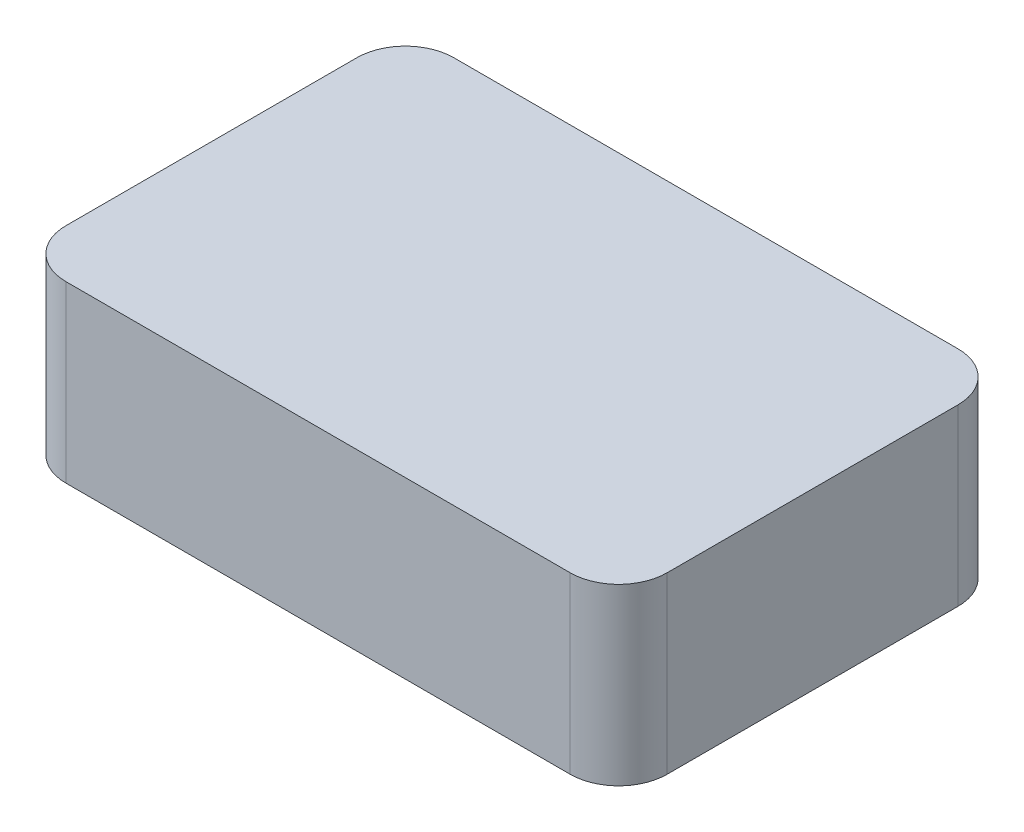
ISO-10303-21;
HEADER;
FILE_DESCRIPTION(('STEP AP214'),'2;1');
FILE_NAME('part.step','',(''),(''),'','','');
FILE_SCHEMA(('AUTOMOTIVE_DESIGN { 1 0 10303 214 1 1 1 1 }'));
ENDSEC;
DATA;
#1=APPLICATION_CONTEXT('core data for automotive mechanical design processes');
#2=APPLICATION_PROTOCOL_DEFINITION('international standard','automotive_design',2000,#1);
#3=PRODUCT_CONTEXT('',#1,'mechanical');
#4=PRODUCT('Part','Part','',(#3));
#5=PRODUCT_RELATED_PRODUCT_CATEGORY('part','',(#4));
#6=PRODUCT_DEFINITION_FORMATION('','',#4);
#7=PRODUCT_DEFINITION_CONTEXT('part definition',#1,'design');
#8=PRODUCT_DEFINITION('design','',#6,#7);
#9=PRODUCT_DEFINITION_SHAPE('','',#8);
#10=(LENGTH_UNIT() NAMED_UNIT(*) SI_UNIT(.MILLI.,.METRE.));
#11=(NAMED_UNIT(*) PLANE_ANGLE_UNIT() SI_UNIT($,.RADIAN.));
#12=(NAMED_UNIT(*) SI_UNIT($,.STERADIAN.) SOLID_ANGLE_UNIT());
#13=UNCERTAINTY_MEASURE_WITH_UNIT(LENGTH_MEASURE(1.E-05),#10,'distance_accuracy_value','');
#14=(GEOMETRIC_REPRESENTATION_CONTEXT(3) GLOBAL_UNCERTAINTY_ASSIGNED_CONTEXT((#13)) GLOBAL_UNIT_ASSIGNED_CONTEXT((#10,
#11,#12)) REPRESENTATION_CONTEXT('',''));
#15=CARTESIAN_POINT('',(0.,0.,0.));
#16=DIRECTION('',(0.,0.,1.));
#17=DIRECTION('',(1.,0.,0.));
#18=AXIS2_PLACEMENT_3D('',#15,#16,#17);
#19=CARTESIAN_POINT('',(15.5,4.5,10.));
#20=DIRECTION('',(-1.,0.,0.));
#21=DIRECTION('',(0.,0.,1.));
#22=AXIS2_PLACEMENT_3D('',#19,#20,#21);
#23=PLANE('',#22);
#24=DIRECTION('',(0.,0.,-1.));
#25=VECTOR('',#24,1.);
#26=CARTESIAN_POINT('',(15.5,-4.5,10.));
#27=LINE('',#26,#25);
#28=CARTESIAN_POINT('',(15.5,-4.5,7.5));
#29=VERTEX_POINT('',#28);
#30=CARTESIAN_POINT('',(15.5,-4.5,-7.5));
#31=VERTEX_POINT('',#30);
#32=EDGE_CURVE('E143',#29,#31,#27,.T.);
#33=ORIENTED_EDGE('',*,*,#32,.T.);
#34=DIRECTION('',(0.,-1.,0.));
#35=VECTOR('',#34,1.);
#36=CARTESIAN_POINT('',(15.5,4.5,-7.5));
#37=LINE('',#36,#35);
#38=CARTESIAN_POINT('',(15.5,4.5,-7.5));
#39=VERTEX_POINT('',#38);
#40=EDGE_CURVE('E177',#31,#39,#37,.F.);
#41=ORIENTED_EDGE('',*,*,#40,.T.);
#42=DIRECTION('',(0.,0.,-1.));
#43=VECTOR('',#42,1.);
#44=CARTESIAN_POINT('',(15.5,4.5,10.));
#45=LINE('',#44,#43);
#46=CARTESIAN_POINT('',(15.5,4.5,7.5));
#47=VERTEX_POINT('',#46);
#48=EDGE_CURVE('E141',#47,#39,#45,.T.);
#49=ORIENTED_EDGE('',*,*,#48,.F.);
#50=DIRECTION('',(0.,-1.,0.));
#51=VECTOR('',#50,1.);
#52=CARTESIAN_POINT('',(15.5,4.5,7.5));
#53=LINE('',#52,#51);
#54=EDGE_CURVE('E173',#47,#29,#53,.T.);
#55=ORIENTED_EDGE('',*,*,#54,.T.);
#56=EDGE_LOOP('',(#33,#41,#49,#55));
#57=FACE_BOUND('',#56,.T.);
#58=ADVANCED_FACE('F42',(#57),#23,.F.);
#59=CARTESIAN_POINT('',(-15.5,4.5,-10.));
#60=DIRECTION('',(0.,0.,1.));
#61=DIRECTION('',(1.,0.,0.));
#62=AXIS2_PLACEMENT_3D('',#59,#60,#61);
#63=PLANE('',#62);
#64=DIRECTION('',(-1.,0.,0.));
#65=VECTOR('',#64,1.);
#66=CARTESIAN_POINT('',(-15.5,-4.5,-10.));
#67=LINE('',#66,#65);
#68=CARTESIAN_POINT('',(13.,-4.5,-10.));
#69=VERTEX_POINT('',#68);
#70=CARTESIAN_POINT('',(-13.,-4.5,-10.));
#71=VERTEX_POINT('',#70);
#72=EDGE_CURVE('E137',#69,#71,#67,.T.);
#73=ORIENTED_EDGE('',*,*,#72,.T.);
#74=DIRECTION('',(0.,-1.,0.));
#75=VECTOR('',#74,1.);
#76=CARTESIAN_POINT('',(-13.,4.5,-10.));
#77=LINE('',#76,#75);
#78=CARTESIAN_POINT('',(-13.,4.5,-10.));
#79=VERTEX_POINT('',#78);
#80=EDGE_CURVE('E113',#71,#79,#77,.F.);
#81=ORIENTED_EDGE('',*,*,#80,.T.);
#82=DIRECTION('',(-1.,0.,0.));
#83=VECTOR('',#82,1.);
#84=CARTESIAN_POINT('',(-15.5,4.5,-10.));
#85=LINE('',#84,#83);
#86=CARTESIAN_POINT('',(13.,4.5,-10.));
#87=VERTEX_POINT('',#86);
#88=EDGE_CURVE('E196',#87,#79,#85,.T.);
#89=ORIENTED_EDGE('',*,*,#88,.F.);
#90=DIRECTION('',(0.,-1.,0.));
#91=VECTOR('',#90,1.);
#92=CARTESIAN_POINT('',(13.,4.5,-10.));
#93=LINE('',#92,#91);
#94=EDGE_CURVE('E119',#87,#69,#93,.T.);
#95=ORIENTED_EDGE('',*,*,#94,.T.);
#96=EDGE_LOOP('',(#73,#81,#89,#95));
#97=FACE_BOUND('',#96,.T.);
#98=ADVANCED_FACE('F217',(#97),#63,.F.);
#99=CARTESIAN_POINT('',(-15.5,4.5,10.));
#100=DIRECTION('',(1.,0.,0.));
#101=DIRECTION('',(0.,0.,-1.));
#102=AXIS2_PLACEMENT_3D('',#99,#100,#101);
#103=PLANE('',#102);
#104=DIRECTION('',(0.,0.,1.));
#105=VECTOR('',#104,1.);
#106=CARTESIAN_POINT('',(-15.5,4.5,10.));
#107=LINE('',#106,#105);
#108=CARTESIAN_POINT('',(-15.5,4.5,-7.5));
#109=VERTEX_POINT('',#108);
#110=CARTESIAN_POINT('',(-15.5,4.5,7.5));
#111=VERTEX_POINT('',#110);
#112=EDGE_CURVE('E128',#109,#111,#107,.T.);
#113=ORIENTED_EDGE('',*,*,#112,.F.);
#114=DIRECTION('',(0.,-1.,0.));
#115=VECTOR('',#114,1.);
#116=CARTESIAN_POINT('',(-15.5,4.5,-7.5));
#117=LINE('',#116,#115);
#118=CARTESIAN_POINT('',(-15.5,-4.5,-7.5));
#119=VERTEX_POINT('',#118);
#120=EDGE_CURVE('E112',#109,#119,#117,.T.);
#121=ORIENTED_EDGE('',*,*,#120,.T.);
#122=DIRECTION('',(0.,0.,1.));
#123=VECTOR('',#122,1.);
#124=CARTESIAN_POINT('',(-15.5,-4.5,10.));
#125=LINE('',#124,#123);
#126=CARTESIAN_POINT('',(-15.5,-4.5,7.5));
#127=VERTEX_POINT('',#126);
#128=EDGE_CURVE('E126',#119,#127,#125,.T.);
#129=ORIENTED_EDGE('',*,*,#128,.T.);
#130=DIRECTION('',(0.,-1.,0.));
#131=VECTOR('',#130,1.);
#132=CARTESIAN_POINT('',(-15.5,4.5,7.5));
#133=LINE('',#132,#131);
#134=EDGE_CURVE('E131',#127,#111,#133,.F.);
#135=ORIENTED_EDGE('',*,*,#134,.T.);
#136=EDGE_LOOP('',(#113,#121,#129,#135));
#137=FACE_BOUND('',#136,.T.);
#138=ADVANCED_FACE('F125',(#137),#103,.F.);
#139=CARTESIAN_POINT('',(-15.5,4.5,10.));
#140=DIRECTION('',(0.,0.,-1.));
#141=DIRECTION('',(-1.,0.,0.));
#142=AXIS2_PLACEMENT_3D('',#139,#140,#141);
#143=PLANE('',#142);
#144=DIRECTION('',(1.,0.,0.));
#145=VECTOR('',#144,1.);
#146=CARTESIAN_POINT('',(-15.5,-4.5,10.));
#147=LINE('',#146,#145);
#148=CARTESIAN_POINT('',(-13.,-4.5,10.));
#149=VERTEX_POINT('',#148);
#150=CARTESIAN_POINT('',(13.,-4.5,10.));
#151=VERTEX_POINT('',#150);
#152=EDGE_CURVE('E136',#149,#151,#147,.T.);
#153=ORIENTED_EDGE('',*,*,#152,.T.);
#154=DIRECTION('',(0.,-1.,0.));
#155=VECTOR('',#154,1.);
#156=CARTESIAN_POINT('',(13.,4.5,10.));
#157=LINE('',#156,#155);
#158=CARTESIAN_POINT('',(13.,4.5,10.));
#159=VERTEX_POINT('',#158);
#160=EDGE_CURVE('E11',#151,#159,#157,.F.);
#161=ORIENTED_EDGE('',*,*,#160,.T.);
#162=DIRECTION('',(1.,0.,0.));
#163=VECTOR('',#162,1.);
#164=CARTESIAN_POINT('',(-15.5,4.5,10.));
#165=LINE('',#164,#163);
#166=CARTESIAN_POINT('',(-13.,4.5,10.));
#167=VERTEX_POINT('',#166);
#168=EDGE_CURVE('E148',#167,#159,#165,.T.);
#169=ORIENTED_EDGE('',*,*,#168,.F.);
#170=DIRECTION('',(0.,-1.,0.));
#171=VECTOR('',#170,1.);
#172=CARTESIAN_POINT('',(-13.,4.5,10.));
#173=LINE('',#172,#171);
#174=EDGE_CURVE('E51',#167,#149,#173,.T.);
#175=ORIENTED_EDGE('',*,*,#174,.T.);
#176=EDGE_LOOP('',(#153,#161,#169,#175));
#177=FACE_BOUND('',#176,.T.);
#178=ADVANCED_FACE('F182',(#177),#143,.F.);
#179=CARTESIAN_POINT('',(0.,4.5,0.));
#180=DIRECTION('',(0.,-1.,0.));
#181=DIRECTION('',(0.,0.,-1.));
#182=AXIS2_PLACEMENT_3D('',#179,#180,#181);
#183=PLANE('',#182);
#184=ORIENTED_EDGE('',*,*,#88,.T.);
#185=CARTESIAN_POINT('',(-13.,4.5,-7.5));
#186=DIRECTION('',(0.,-1.,0.));
#187=DIRECTION('',(0.,0.,-1.));
#188=AXIS2_PLACEMENT_3D('',#185,#186,#187);
#189=CIRCLE('',#188,2.5);
#190=EDGE_CURVE('E170',#79,#109,#189,.F.);
#191=ORIENTED_EDGE('',*,*,#190,.T.);
#192=ORIENTED_EDGE('',*,*,#112,.T.);
#193=CARTESIAN_POINT('',(-13.,4.5,7.5));
#194=DIRECTION('',(0.,-1.,0.));
#195=DIRECTION('',(0.,0.,-1.));
#196=AXIS2_PLACEMENT_3D('',#193,#194,#195);
#197=CIRCLE('',#196,2.5);
#198=EDGE_CURVE('E63',#111,#167,#197,.F.);
#199=ORIENTED_EDGE('',*,*,#198,.T.);
#200=ORIENTED_EDGE('',*,*,#168,.T.);
#201=CARTESIAN_POINT('',(13.,4.5,7.5));
#202=DIRECTION('',(0.,-1.,0.));
#203=DIRECTION('',(0.,0.,-1.));
#204=AXIS2_PLACEMENT_3D('',#201,#202,#203);
#205=CIRCLE('',#204,2.5);
#206=EDGE_CURVE('E164',#159,#47,#205,.F.);
#207=ORIENTED_EDGE('',*,*,#206,.T.);
#208=ORIENTED_EDGE('',*,*,#48,.T.);
#209=CARTESIAN_POINT('',(13.,4.5,-7.5));
#210=DIRECTION('',(0.,-1.,0.));
#211=DIRECTION('',(0.,0.,-1.));
#212=AXIS2_PLACEMENT_3D('',#209,#210,#211);
#213=CIRCLE('',#212,2.5);
#214=EDGE_CURVE('E167',#39,#87,#213,.F.);
#215=ORIENTED_EDGE('',*,*,#214,.T.);
#216=EDGE_LOOP('',(#184,#191,#192,#199,#200,#207,#208,#215));
#217=FACE_BOUND('',#216,.T.);
#218=ADVANCED_FACE('F206',(#217),#183,.F.);
#219=CARTESIAN_POINT('',(0.,-4.5,0.));
#220=DIRECTION('',(0.,-1.,0.));
#221=DIRECTION('',(0.,0.,-1.));
#222=AXIS2_PLACEMENT_3D('',#219,#220,#221);
#223=PLANE('',#222);
#224=ORIENTED_EDGE('',*,*,#128,.F.);
#225=CARTESIAN_POINT('',(-13.,-4.5,-7.5));
#226=DIRECTION('',(0.,-1.,0.));
#227=DIRECTION('',(0.,0.,-1.));
#228=AXIS2_PLACEMENT_3D('',#225,#226,#227);
#229=CIRCLE('',#228,2.5);
#230=EDGE_CURVE('E108',#119,#71,#229,.T.);
#231=ORIENTED_EDGE('',*,*,#230,.T.);
#232=ORIENTED_EDGE('',*,*,#72,.F.);
#233=CARTESIAN_POINT('',(13.,-4.5,-7.5));
#234=DIRECTION('',(0.,-1.,0.));
#235=DIRECTION('',(0.,0.,-1.));
#236=AXIS2_PLACEMENT_3D('',#233,#234,#235);
#237=CIRCLE('',#236,2.5);
#238=EDGE_CURVE('E120',#69,#31,#237,.T.);
#239=ORIENTED_EDGE('',*,*,#238,.T.);
#240=ORIENTED_EDGE('',*,*,#32,.F.);
#241=CARTESIAN_POINT('',(13.,-4.5,7.5));
#242=DIRECTION('',(0.,-1.,0.));
#243=DIRECTION('',(0.,0.,-1.));
#244=AXIS2_PLACEMENT_3D('',#241,#242,#243);
#245=CIRCLE('',#244,2.5);
#246=EDGE_CURVE('E152',#29,#151,#245,.T.);
#247=ORIENTED_EDGE('',*,*,#246,.T.);
#248=ORIENTED_EDGE('',*,*,#152,.F.);
#249=CARTESIAN_POINT('',(-13.,-4.5,7.5));
#250=DIRECTION('',(0.,-1.,0.));
#251=DIRECTION('',(0.,0.,-1.));
#252=AXIS2_PLACEMENT_3D('',#249,#250,#251);
#253=CIRCLE('',#252,2.5);
#254=EDGE_CURVE('E130',#149,#127,#253,.T.);
#255=ORIENTED_EDGE('',*,*,#254,.T.);
#256=EDGE_LOOP('',(#224,#231,#232,#239,#240,#247,#248,#255));
#257=FACE_BOUND('',#256,.T.);
#258=ADVANCED_FACE('F133',(#257),#223,.T.);
#259=CARTESIAN_POINT('',(-13.,4.5,-7.5));
#260=DIRECTION('',(0.,-1.,0.));
#261=DIRECTION('',(0.,0.,-1.));
#262=AXIS2_PLACEMENT_3D('',#259,#260,#261);
#263=CYLINDRICAL_SURFACE('',#262,2.5);
#264=ORIENTED_EDGE('',*,*,#190,.F.);
#265=ORIENTED_EDGE('',*,*,#80,.F.);
#266=ORIENTED_EDGE('',*,*,#230,.F.);
#267=ORIENTED_EDGE('',*,*,#120,.F.);
#268=EDGE_LOOP('',(#264,#265,#266,#267));
#269=FACE_BOUND('',#268,.T.);
#270=ADVANCED_FACE('F111',(#269),#263,.T.);
#271=CARTESIAN_POINT('',(13.,4.5,-7.5));
#272=DIRECTION('',(0.,-1.,0.));
#273=DIRECTION('',(0.,0.,-1.));
#274=AXIS2_PLACEMENT_3D('',#271,#272,#273);
#275=CYLINDRICAL_SURFACE('',#274,2.5);
#276=ORIENTED_EDGE('',*,*,#214,.F.);
#277=ORIENTED_EDGE('',*,*,#40,.F.);
#278=ORIENTED_EDGE('',*,*,#238,.F.);
#279=ORIENTED_EDGE('',*,*,#94,.F.);
#280=EDGE_LOOP('',(#276,#277,#278,#279));
#281=FACE_BOUND('',#280,.T.);
#282=ADVANCED_FACE('F228',(#281),#275,.T.);
#283=CARTESIAN_POINT('',(13.,4.5,7.5));
#284=DIRECTION('',(0.,-1.,0.));
#285=DIRECTION('',(0.,0.,-1.));
#286=AXIS2_PLACEMENT_3D('',#283,#284,#285);
#287=CYLINDRICAL_SURFACE('',#286,2.5);
#288=ORIENTED_EDGE('',*,*,#206,.F.);
#289=ORIENTED_EDGE('',*,*,#160,.F.);
#290=ORIENTED_EDGE('',*,*,#246,.F.);
#291=ORIENTED_EDGE('',*,*,#54,.F.);
#292=EDGE_LOOP('',(#288,#289,#290,#291));
#293=FACE_BOUND('',#292,.T.);
#294=ADVANCED_FACE('F189',(#293),#287,.T.);
#295=CARTESIAN_POINT('',(-13.,4.5,7.5));
#296=DIRECTION('',(0.,-1.,0.));
#297=DIRECTION('',(0.,0.,-1.));
#298=AXIS2_PLACEMENT_3D('',#295,#296,#297);
#299=CYLINDRICAL_SURFACE('',#298,2.5);
#300=ORIENTED_EDGE('',*,*,#198,.F.);
#301=ORIENTED_EDGE('',*,*,#134,.F.);
#302=ORIENTED_EDGE('',*,*,#254,.F.);
#303=ORIENTED_EDGE('',*,*,#174,.F.);
#304=EDGE_LOOP('',(#300,#301,#302,#303));
#305=FACE_BOUND('',#304,.T.);
#306=ADVANCED_FACE('F44',(#305),#299,.T.);
#307=CLOSED_SHELL('',(#58,#98,#138,#178,#218,#258,#270,#282,#294,#306));
#308=MANIFOLD_SOLID_BREP('B2',#307);
#309=ADVANCED_BREP_SHAPE_REPRESENTATION('',(#18,#308),#14);
#310=SHAPE_DEFINITION_REPRESENTATION(#9,#309);
ENDSEC;
END-ISO-10303-21;
